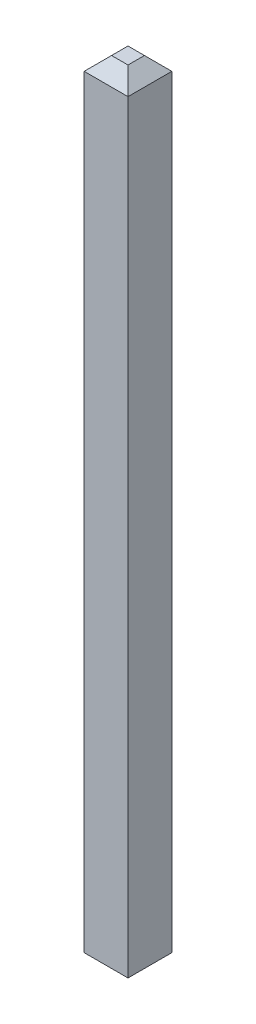
ISO-10303-21;
HEADER;
FILE_DESCRIPTION(('STEP AP214'),'2;1');
FILE_NAME('part.step','',(''),(''),'','','');
FILE_SCHEMA(('AUTOMOTIVE_DESIGN { 1 0 10303 214 1 1 1 1 }'));
ENDSEC;
DATA;
#1=APPLICATION_CONTEXT('core data for automotive mechanical design processes');
#2=APPLICATION_PROTOCOL_DEFINITION('international standard','automotive_design',2000,#1);
#3=PRODUCT_CONTEXT('',#1,'mechanical');
#4=PRODUCT('Part','Part','',(#3));
#5=PRODUCT_RELATED_PRODUCT_CATEGORY('part','',(#4));
#6=PRODUCT_DEFINITION_FORMATION('','',#4);
#7=PRODUCT_DEFINITION_CONTEXT('part definition',#1,'design');
#8=PRODUCT_DEFINITION('design','',#6,#7);
#9=PRODUCT_DEFINITION_SHAPE('','',#8);
#10=(LENGTH_UNIT() NAMED_UNIT(*) SI_UNIT(.MILLI.,.METRE.));
#11=(NAMED_UNIT(*) PLANE_ANGLE_UNIT() SI_UNIT($,.RADIAN.));
#12=(NAMED_UNIT(*) SI_UNIT($,.STERADIAN.) SOLID_ANGLE_UNIT());
#13=UNCERTAINTY_MEASURE_WITH_UNIT(LENGTH_MEASURE(1.E-05),#10,'distance_accuracy_value','');
#14=(GEOMETRIC_REPRESENTATION_CONTEXT(3) GLOBAL_UNCERTAINTY_ASSIGNED_CONTEXT((#13)) GLOBAL_UNIT_ASSIGNED_CONTEXT((#10,
#11,#12)) REPRESENTATION_CONTEXT('',''));
#15=CARTESIAN_POINT('',(0.,0.,0.));
#16=DIRECTION('',(0.,0.,1.));
#17=DIRECTION('',(1.,0.,0.));
#18=AXIS2_PLACEMENT_3D('',#15,#16,#17);
#19=CARTESIAN_POINT('',(9.21,7.07,-0.32));
#20=DIRECTION('',(-0.707106781186548,-0.707106781186548,0.));
#21=DIRECTION('',(-0.707106781186548,0.707106781186548,0.));
#22=AXIS2_PLACEMENT_3D('',#19,#20,#21);
#23=PLANE('',#22);
#24=DIRECTION('',(0.577350269189626,-0.577350269189626,0.577350269189626));
#25=VECTOR('',#24,1.);
#26=CARTESIAN_POINT('',(8.996666666667,7.283333333333,0.106666666667));
#27=LINE('',#26,#25);
#28=CARTESIAN_POINT('',(9.01,7.27,0.12));
#29=VERTEX_POINT('',#28);
#30=CARTESIAN_POINT('',(9.21,7.07,0.32));
#31=VERTEX_POINT('',#30);
#32=EDGE_CURVE('E135',#29,#31,#27,.T.);
#33=ORIENTED_EDGE('',*,*,#32,.T.);
#34=DIRECTION('',(0.,0.,1.));
#35=VECTOR('',#34,1.);
#36=CARTESIAN_POINT('',(9.21,7.07,-0.32));
#37=LINE('',#36,#35);
#38=CARTESIAN_POINT('',(9.21,7.07,-0.32));
#39=VERTEX_POINT('',#38);
#40=EDGE_CURVE('E144',#39,#31,#37,.T.);
#41=ORIENTED_EDGE('',*,*,#40,.F.);
#42=DIRECTION('',(0.577350269189626,-0.577350269189626,-0.577350269189626));
#43=VECTOR('',#42,1.);
#44=CARTESIAN_POINT('',(9.21,7.07,-0.32));
#45=LINE('',#44,#43);
#46=CARTESIAN_POINT('',(9.01,7.27,-0.12));
#47=VERTEX_POINT('',#46);
#48=EDGE_CURVE('E11',#47,#39,#45,.T.);
#49=ORIENTED_EDGE('',*,*,#48,.F.);
#50=DIRECTION('',(0.,0.,-1.));
#51=VECTOR('',#50,1.);
#52=CARTESIAN_POINT('',(9.01,7.27,-0.32));
#53=LINE('',#52,#51);
#54=EDGE_CURVE('E194',#29,#47,#53,.T.);
#55=ORIENTED_EDGE('',*,*,#54,.F.);
#56=EDGE_LOOP('',(#33,#41,#49,#55));
#57=FACE_BOUND('',#56,.T.);
#58=ADVANCED_FACE('F16',(#57),#23,.F.);
#59=CARTESIAN_POINT('',(8.89,7.07,-0.32));
#60=DIRECTION('',(0.,0.707106781186548,-0.707106781186548));
#61=DIRECTION('',(-1.,0.,0.));
#62=AXIS2_PLACEMENT_3D('',#59,#60,#61);
#63=PLANE('',#62);
#64=DIRECTION('',(0.577350269189626,0.577350269189626,0.577350269189626));
#65=VECTOR('',#64,1.);
#66=CARTESIAN_POINT('',(8.703333333333,7.203333333333,-0.186666666667));
#67=LINE('',#66,#65);
#68=CARTESIAN_POINT('',(8.57,7.07,-0.32));
#69=VERTEX_POINT('',#68);
#70=CARTESIAN_POINT('',(8.77,7.27,-0.12));
#71=VERTEX_POINT('',#70);
#72=EDGE_CURVE('E27',#69,#71,#67,.T.);
#73=ORIENTED_EDGE('',*,*,#72,.T.);
#74=DIRECTION('',(-1.,0.,0.));
#75=VECTOR('',#74,1.);
#76=CARTESIAN_POINT('',(8.57,7.27,-0.12));
#77=LINE('',#76,#75);
#78=EDGE_CURVE('E186',#47,#71,#77,.T.);
#79=ORIENTED_EDGE('',*,*,#78,.F.);
#80=ORIENTED_EDGE('',*,*,#48,.T.);
#81=DIRECTION('',(1.,0.,0.));
#82=VECTOR('',#81,1.);
#83=CARTESIAN_POINT('',(9.21,7.07,-0.32));
#84=LINE('',#83,#82);
#85=EDGE_CURVE('E161',#69,#39,#84,.T.);
#86=ORIENTED_EDGE('',*,*,#85,.F.);
#87=EDGE_LOOP('',(#73,#79,#80,#86));
#88=FACE_BOUND('',#87,.T.);
#89=ADVANCED_FACE('F184',(#88),#63,.T.);
#90=CARTESIAN_POINT('',(8.77,7.27,-0.32));
#91=DIRECTION('',(0.707106781186548,-0.707106781186548,0.));
#92=DIRECTION('',(0.,0.,-1.));
#93=AXIS2_PLACEMENT_3D('',#90,#91,#92);
#94=PLANE('',#93);
#95=DIRECTION('',(-0.577350269189626,-0.577350269189626,0.577350269189626));
#96=VECTOR('',#95,1.);
#97=CARTESIAN_POINT('',(8.703333333333,7.203333333333,0.186666666667));
#98=LINE('',#97,#96);
#99=CARTESIAN_POINT('',(8.77,7.27,0.12));
#100=VERTEX_POINT('',#99);
#101=CARTESIAN_POINT('',(8.57,7.07,0.32));
#102=VERTEX_POINT('',#101);
#103=EDGE_CURVE('E41',#100,#102,#98,.T.);
#104=ORIENTED_EDGE('',*,*,#103,.F.);
#105=DIRECTION('',(0.,0.,1.));
#106=VECTOR('',#105,1.);
#107=CARTESIAN_POINT('',(8.77,7.27,-0.32));
#108=LINE('',#107,#106);
#109=EDGE_CURVE('E188',#71,#100,#108,.T.);
#110=ORIENTED_EDGE('',*,*,#109,.F.);
#111=ORIENTED_EDGE('',*,*,#72,.F.);
#112=DIRECTION('',(0.,0.,-1.));
#113=VECTOR('',#112,1.);
#114=CARTESIAN_POINT('',(8.57,7.07,-0.32));
#115=LINE('',#114,#113);
#116=EDGE_CURVE('E145',#102,#69,#115,.T.);
#117=ORIENTED_EDGE('',*,*,#116,.F.);
#118=EDGE_LOOP('',(#104,#110,#111,#117));
#119=FACE_BOUND('',#118,.T.);
#120=ADVANCED_FACE('F146',(#119),#94,.F.);
#121=CARTESIAN_POINT('',(8.57,7.27,0.12));
#122=DIRECTION('',(0.,-0.707106781186548,-0.707106781186548));
#123=DIRECTION('',(0.,-0.707106781186548,0.707106781186548));
#124=AXIS2_PLACEMENT_3D('',#121,#122,#123);
#125=PLANE('',#124);
#126=ORIENTED_EDGE('',*,*,#32,.F.);
#127=DIRECTION('',(1.,0.,0.));
#128=VECTOR('',#127,1.);
#129=CARTESIAN_POINT('',(8.57,7.27,0.12));
#130=LINE('',#129,#128);
#131=EDGE_CURVE('E132',#100,#29,#130,.T.);
#132=ORIENTED_EDGE('',*,*,#131,.F.);
#133=ORIENTED_EDGE('',*,*,#103,.T.);
#134=DIRECTION('',(-1.,0.,0.));
#135=VECTOR('',#134,1.);
#136=CARTESIAN_POINT('',(8.89,7.07,0.32));
#137=LINE('',#136,#135);
#138=EDGE_CURVE('E130',#31,#102,#137,.T.);
#139=ORIENTED_EDGE('',*,*,#138,.F.);
#140=EDGE_LOOP('',(#126,#132,#133,#139));
#141=FACE_BOUND('',#140,.T.);
#142=ADVANCED_FACE('F129',(#141),#125,.F.);
#143=CARTESIAN_POINT('',(8.57,7.27,-0.32));
#144=DIRECTION('',(0.,-1.,0.));
#145=DIRECTION('',(0.,0.,-1.));
#146=AXIS2_PLACEMENT_3D('',#143,#144,#145);
#147=PLANE('',#146);
#148=ORIENTED_EDGE('',*,*,#54,.T.);
#149=ORIENTED_EDGE('',*,*,#78,.T.);
#150=ORIENTED_EDGE('',*,*,#109,.T.);
#151=ORIENTED_EDGE('',*,*,#131,.T.);
#152=EDGE_LOOP('',(#148,#149,#150,#151));
#153=FACE_BOUND('',#152,.T.);
#154=ADVANCED_FACE('F192',(#153),#147,.F.);
#155=CARTESIAN_POINT('',(9.21,7.27,-0.32));
#156=DIRECTION('',(-1.,0.,0.));
#157=DIRECTION('',(0.,1.,0.));
#158=AXIS2_PLACEMENT_3D('',#155,#156,#157);
#159=PLANE('',#158);
#160=DIRECTION('',(0.,-1.,0.));
#161=VECTOR('',#160,1.);
#162=CARTESIAN_POINT('',(9.21,7.27,-0.32));
#163=LINE('',#162,#161);
#164=CARTESIAN_POINT('',(9.21,-4.07,-0.32));
#165=VERTEX_POINT('',#164);
#166=EDGE_CURVE('E156',#39,#165,#163,.T.);
#167=ORIENTED_EDGE('',*,*,#166,.F.);
#168=ORIENTED_EDGE('',*,*,#40,.T.);
#169=DIRECTION('',(0.,-1.,0.));
#170=VECTOR('',#169,1.);
#171=CARTESIAN_POINT('',(9.21,7.27,0.32));
#172=LINE('',#171,#170);
#173=CARTESIAN_POINT('',(9.21,-4.07,0.32));
#174=VERTEX_POINT('',#173);
#175=EDGE_CURVE('E123',#31,#174,#172,.T.);
#176=ORIENTED_EDGE('',*,*,#175,.T.);
#177=DIRECTION('',(0.,0.,-1.));
#178=VECTOR('',#177,1.);
#179=CARTESIAN_POINT('',(9.21,-4.07,-0.32));
#180=LINE('',#179,#178);
#181=EDGE_CURVE('E83',#174,#165,#180,.T.);
#182=ORIENTED_EDGE('',*,*,#181,.T.);
#183=EDGE_LOOP('',(#167,#168,#176,#182));
#184=FACE_BOUND('',#183,.T.);
#185=ADVANCED_FACE('F236',(#184),#159,.F.);
#186=CARTESIAN_POINT('',(8.89,1.5,0.32));
#187=DIRECTION('',(0.,0.,-1.));
#188=DIRECTION('',(0.,-1.,0.));
#189=AXIS2_PLACEMENT_3D('',#186,#187,#188);
#190=PLANE('',#189);
#191=ORIENTED_EDGE('',*,*,#175,.F.);
#192=ORIENTED_EDGE('',*,*,#138,.T.);
#193=DIRECTION('',(0.,1.,0.));
#194=VECTOR('',#193,1.);
#195=CARTESIAN_POINT('',(8.57,-4.27,0.32));
#196=LINE('',#195,#194);
#197=CARTESIAN_POINT('',(8.57,-4.07,0.32));
#198=VERTEX_POINT('',#197);
#199=EDGE_CURVE('E142',#198,#102,#196,.T.);
#200=ORIENTED_EDGE('',*,*,#199,.F.);
#201=DIRECTION('',(1.,0.,0.));
#202=VECTOR('',#201,1.);
#203=CARTESIAN_POINT('',(8.89,-4.07,0.32));
#204=LINE('',#203,#202);
#205=EDGE_CURVE('E215',#198,#174,#204,.T.);
#206=ORIENTED_EDGE('',*,*,#205,.T.);
#207=EDGE_LOOP('',(#191,#192,#200,#206));
#208=FACE_BOUND('',#207,.T.);
#209=ADVANCED_FACE('F139',(#208),#190,.F.);
#210=CARTESIAN_POINT('',(9.01,-4.27,-0.32));
#211=DIRECTION('',(-0.707106781186548,0.707106781186548,0.));
#212=DIRECTION('',(0.,0.,1.));
#213=AXIS2_PLACEMENT_3D('',#210,#211,#212);
#214=PLANE('',#213);
#215=DIRECTION('',(-0.577350269189626,-0.577350269189626,0.577350269189626));
#216=VECTOR('',#215,1.);
#217=CARTESIAN_POINT('',(9.076666666667,-4.203333333333,-0.186666666667));
#218=LINE('',#217,#216);
#219=CARTESIAN_POINT('',(9.01,-4.27,-0.12));
#220=VERTEX_POINT('',#219);
#221=EDGE_CURVE('E102',#165,#220,#218,.T.);
#222=ORIENTED_EDGE('',*,*,#221,.F.);
#223=ORIENTED_EDGE('',*,*,#181,.F.);
#224=DIRECTION('',(-0.577350269189626,-0.577350269189626,-0.577350269189626));
#225=VECTOR('',#224,1.);
#226=CARTESIAN_POINT('',(8.863333333333,-4.416666666667,-0.02666666666667));
#227=LINE('',#226,#225);
#228=CARTESIAN_POINT('',(9.01,-4.27,0.12));
#229=VERTEX_POINT('',#228);
#230=EDGE_CURVE('E109',#174,#229,#227,.T.);
#231=ORIENTED_EDGE('',*,*,#230,.T.);
#232=DIRECTION('',(0.,0.,1.));
#233=VECTOR('',#232,1.);
#234=CARTESIAN_POINT('',(9.01,-4.27,-0.32));
#235=LINE('',#234,#233);
#236=EDGE_CURVE('E174',#220,#229,#235,.T.);
#237=ORIENTED_EDGE('',*,*,#236,.F.);
#238=EDGE_LOOP('',(#222,#223,#231,#237));
#239=FACE_BOUND('',#238,.T.);
#240=ADVANCED_FACE('F232',(#239),#214,.F.);
#241=CARTESIAN_POINT('',(9.21,-4.27,0.12));
#242=DIRECTION('',(0.,0.707106781186548,-0.707106781186548));
#243=DIRECTION('',(-1.,0.,0.));
#244=AXIS2_PLACEMENT_3D('',#241,#242,#243);
#245=PLANE('',#244);
#246=ORIENTED_EDGE('',*,*,#230,.F.);
#247=ORIENTED_EDGE('',*,*,#205,.F.);
#248=DIRECTION('',(-0.577350269189626,0.577350269189626,0.577350269189626));
#249=VECTOR('',#248,1.);
#250=CARTESIAN_POINT('',(8.783333333333,-4.283333333333,0.106666666667));
#251=LINE('',#250,#249);
#252=CARTESIAN_POINT('',(8.77,-4.27,0.12));
#253=VERTEX_POINT('',#252);
#254=EDGE_CURVE('E117',#253,#198,#251,.T.);
#255=ORIENTED_EDGE('',*,*,#254,.F.);
#256=DIRECTION('',(-1.,0.,0.));
#257=VECTOR('',#256,1.);
#258=CARTESIAN_POINT('',(9.21,-4.27,0.12));
#259=LINE('',#258,#257);
#260=EDGE_CURVE('E170',#229,#253,#259,.T.);
#261=ORIENTED_EDGE('',*,*,#260,.F.);
#262=EDGE_LOOP('',(#246,#247,#255,#261));
#263=FACE_BOUND('',#262,.T.);
#264=ADVANCED_FACE('F228',(#263),#245,.F.);
#265=CARTESIAN_POINT('',(8.57,-4.07,-0.32));
#266=DIRECTION('',(0.707106781186548,0.707106781186548,0.));
#267=DIRECTION('',(0.,0.,-1.));
#268=AXIS2_PLACEMENT_3D('',#265,#266,#267);
#269=PLANE('',#268);
#270=DIRECTION('',(0.577350269189626,-0.577350269189626,0.577350269189626));
#271=VECTOR('',#270,1.);
#272=CARTESIAN_POINT('',(8.676666666667,-4.176666666667,-0.213333333333));
#273=LINE('',#272,#271);
#274=CARTESIAN_POINT('',(8.57,-4.07,-0.32));
#275=VERTEX_POINT('',#274);
#276=CARTESIAN_POINT('',(8.77,-4.27,-0.12));
#277=VERTEX_POINT('',#276);
#278=EDGE_CURVE('E216',#275,#277,#273,.T.);
#279=ORIENTED_EDGE('',*,*,#278,.T.);
#280=DIRECTION('',(0.,0.,-1.));
#281=VECTOR('',#280,1.);
#282=CARTESIAN_POINT('',(8.77,-4.27,-0.32));
#283=LINE('',#282,#281);
#284=EDGE_CURVE('E20',#253,#277,#283,.T.);
#285=ORIENTED_EDGE('',*,*,#284,.F.);
#286=ORIENTED_EDGE('',*,*,#254,.T.);
#287=DIRECTION('',(0.,0.,1.));
#288=VECTOR('',#287,1.);
#289=CARTESIAN_POINT('',(8.57,-4.07,-0.32));
#290=LINE('',#289,#288);
#291=EDGE_CURVE('E151',#275,#198,#290,.T.);
#292=ORIENTED_EDGE('',*,*,#291,.F.);
#293=EDGE_LOOP('',(#279,#285,#286,#292));
#294=FACE_BOUND('',#293,.T.);
#295=ADVANCED_FACE('F279',(#294),#269,.F.);
#296=CARTESIAN_POINT('',(8.57,-4.27,-0.32));
#297=DIRECTION('',(1.,0.,0.));
#298=DIRECTION('',(0.,0.,1.));
#299=AXIS2_PLACEMENT_3D('',#296,#297,#298);
#300=PLANE('',#299);
#301=ORIENTED_EDGE('',*,*,#199,.T.);
#302=ORIENTED_EDGE('',*,*,#116,.T.);
#303=DIRECTION('',(0.,1.,0.));
#304=VECTOR('',#303,1.);
#305=CARTESIAN_POINT('',(8.57,-4.27,-0.32));
#306=LINE('',#305,#304);
#307=EDGE_CURVE('E165',#275,#69,#306,.T.);
#308=ORIENTED_EDGE('',*,*,#307,.F.);
#309=ORIENTED_EDGE('',*,*,#291,.T.);
#310=EDGE_LOOP('',(#301,#302,#308,#309));
#311=FACE_BOUND('',#310,.T.);
#312=ADVANCED_FACE('F154',(#311),#300,.F.);
#313=CARTESIAN_POINT('',(8.89,1.5,-0.32));
#314=DIRECTION('',(0.,0.,-1.));
#315=DIRECTION('',(0.,-1.,0.));
#316=AXIS2_PLACEMENT_3D('',#313,#314,#315);
#317=PLANE('',#316);
#318=ORIENTED_EDGE('',*,*,#307,.T.);
#319=ORIENTED_EDGE('',*,*,#85,.T.);
#320=ORIENTED_EDGE('',*,*,#166,.T.);
#321=DIRECTION('',(-1.,0.,0.));
#322=VECTOR('',#321,1.);
#323=CARTESIAN_POINT('',(8.57,-4.07,-0.32));
#324=LINE('',#323,#322);
#325=EDGE_CURVE('E207',#165,#275,#324,.T.);
#326=ORIENTED_EDGE('',*,*,#325,.T.);
#327=EDGE_LOOP('',(#318,#319,#320,#326));
#328=FACE_BOUND('',#327,.T.);
#329=ADVANCED_FACE('F235',(#328),#317,.T.);
#330=CARTESIAN_POINT('',(8.89,-4.07,-0.32));
#331=DIRECTION('',(0.,-0.707106781186548,-0.707106781186548));
#332=DIRECTION('',(0.,-0.707106781186548,0.707106781186548));
#333=AXIS2_PLACEMENT_3D('',#330,#331,#332);
#334=PLANE('',#333);
#335=ORIENTED_EDGE('',*,*,#278,.F.);
#336=ORIENTED_EDGE('',*,*,#325,.F.);
#337=ORIENTED_EDGE('',*,*,#221,.T.);
#338=DIRECTION('',(1.,0.,0.));
#339=VECTOR('',#338,1.);
#340=CARTESIAN_POINT('',(9.21,-4.27,-0.12));
#341=LINE('',#340,#339);
#342=EDGE_CURVE('E219',#277,#220,#341,.T.);
#343=ORIENTED_EDGE('',*,*,#342,.F.);
#344=EDGE_LOOP('',(#335,#336,#337,#343));
#345=FACE_BOUND('',#344,.T.);
#346=ADVANCED_FACE('F18',(#345),#334,.T.);
#347=CARTESIAN_POINT('',(9.21,-4.27,-0.32));
#348=DIRECTION('',(0.,1.,0.));
#349=DIRECTION('',(0.,0.,-1.));
#350=AXIS2_PLACEMENT_3D('',#347,#348,#349);
#351=PLANE('',#350);
#352=ORIENTED_EDGE('',*,*,#236,.T.);
#353=ORIENTED_EDGE('',*,*,#260,.T.);
#354=ORIENTED_EDGE('',*,*,#284,.T.);
#355=ORIENTED_EDGE('',*,*,#342,.T.);
#356=EDGE_LOOP('',(#352,#353,#354,#355));
#357=FACE_BOUND('',#356,.T.);
#358=ADVANCED_FACE('F231',(#357),#351,.F.);
#359=CLOSED_SHELL('',(#58,#89,#120,#142,#154,#185,#209,#240,#264,#295,#312,#329,#346,#358));
#360=MANIFOLD_SOLID_BREP('B1',#359);
#361=ADVANCED_BREP_SHAPE_REPRESENTATION('',(#18,#360),#14);
#362=SHAPE_DEFINITION_REPRESENTATION(#9,#361);
ENDSEC;
END-ISO-10303-21;
